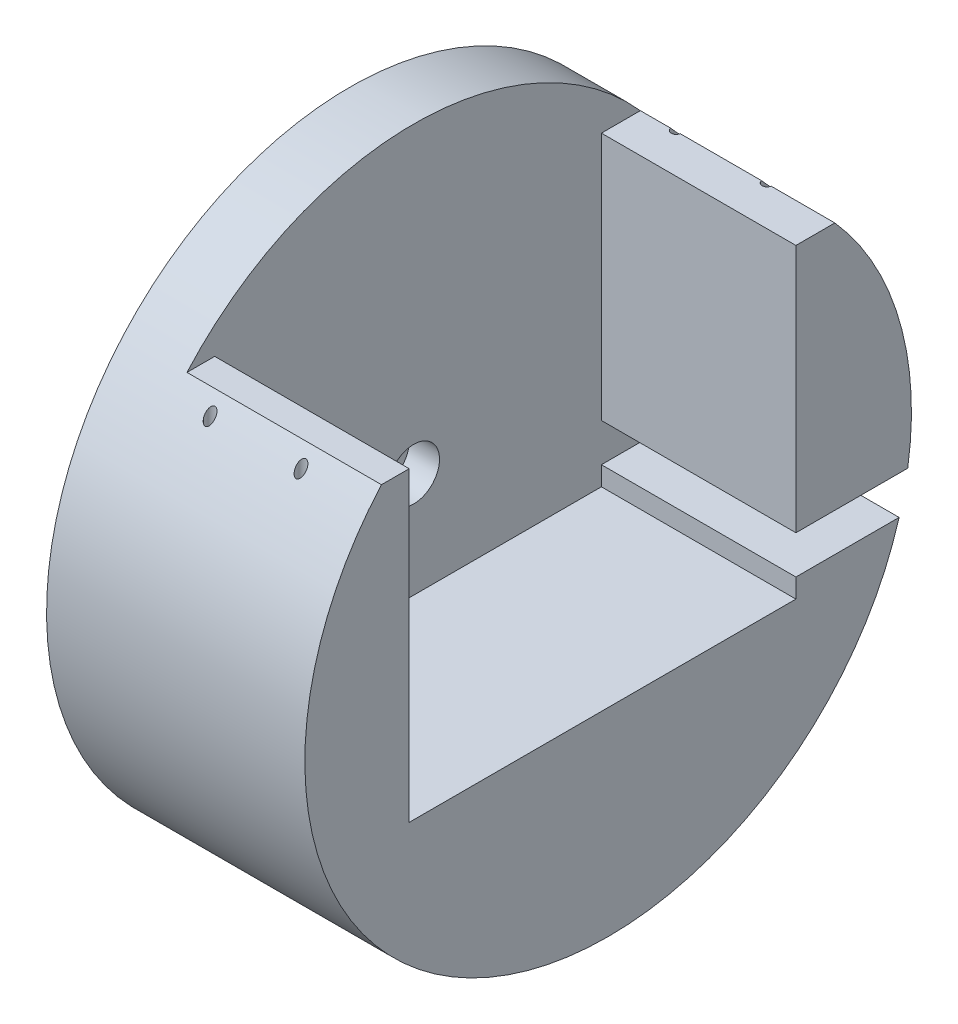
ISO-10303-21;
HEADER;
FILE_DESCRIPTION(('STEP AP214'),'2;1');
FILE_NAME('part.step','',(''),(''),'','','');
FILE_SCHEMA(('AUTOMOTIVE_DESIGN { 1 0 10303 214 1 1 1 1 }'));
ENDSEC;
DATA;
#1=APPLICATION_CONTEXT('core data for automotive mechanical design processes');
#2=APPLICATION_PROTOCOL_DEFINITION('international standard','automotive_design',2000,#1);
#3=PRODUCT_CONTEXT('',#1,'mechanical');
#4=PRODUCT('Part','Part','',(#3));
#5=PRODUCT_RELATED_PRODUCT_CATEGORY('part','',(#4));
#6=PRODUCT_DEFINITION_FORMATION('','',#4);
#7=PRODUCT_DEFINITION_CONTEXT('part definition',#1,'design');
#8=PRODUCT_DEFINITION('design','',#6,#7);
#9=PRODUCT_DEFINITION_SHAPE('','',#8);
#10=(LENGTH_UNIT() NAMED_UNIT(*) SI_UNIT(.MILLI.,.METRE.));
#11=(NAMED_UNIT(*) PLANE_ANGLE_UNIT() SI_UNIT($,.RADIAN.));
#12=(NAMED_UNIT(*) SI_UNIT($,.STERADIAN.) SOLID_ANGLE_UNIT());
#13=UNCERTAINTY_MEASURE_WITH_UNIT(LENGTH_MEASURE(1.E-05),#10,'distance_accuracy_value','');
#14=(GEOMETRIC_REPRESENTATION_CONTEXT(3) GLOBAL_UNCERTAINTY_ASSIGNED_CONTEXT((#13)) GLOBAL_UNIT_ASSIGNED_CONTEXT((#10,
#11,#12)) REPRESENTATION_CONTEXT('',''));
#15=CARTESIAN_POINT('',(0.,0.,0.));
#16=DIRECTION('',(0.,0.,1.));
#17=DIRECTION('',(1.,0.,0.));
#18=AXIS2_PLACEMENT_3D('',#15,#16,#17);
#19=CARTESIAN_POINT('',(26.9875,0.,0.));
#20=DIRECTION('',(-1.,0.,0.));
#21=DIRECTION('',(0.,0.,1.));
#22=AXIS2_PLACEMENT_3D('',#19,#20,#21);
#23=CYLINDRICAL_SURFACE('',#22,31.6865);
#24=CARTESIAN_POINT('',(19.83,18.8894553835808,25.4405730588309));
#25=CARTESIAN_POINT('',(19.8093102805262,18.8894585338143,25.4405707558764));
#26=CARTESIAN_POINT('',(19.7885869551605,18.8911804631478,25.4392924776839));
#27=CARTESIAN_POINT('',(19.7479522247744,18.8978685636467,25.4343244834897));
#28=CARTESIAN_POINT('',(19.728043167384,18.9028434970198,25.4306282545463));
#29=CARTESIAN_POINT('',(19.6898609663298,18.9154501320512,25.4212526941045));
#30=CARTESIAN_POINT('',(19.6715724136049,18.9230524148981,25.4155953197819));
#31=CARTESIAN_POINT('',(19.6366440755752,18.9403521521329,25.402705749786));
#32=CARTESIAN_POINT('',(19.6200046567926,18.9500500707623,25.395473205166));
#33=CARTESIAN_POINT('',(19.5794586252006,18.9769859469778,25.3753562089654));
#34=CARTESIAN_POINT('',(19.5567660540923,18.9953857498577,25.3615890520432));
#35=CARTESIAN_POINT('',(19.5151830959073,19.0347197921008,25.3320811791229));
#36=CARTESIAN_POINT('',(19.4963035165116,19.0556609735175,25.3163350529828));
#37=CARTESIAN_POINT('',(19.451608827369,19.1122661221448,25.2736513671141));
#38=CARTESIAN_POINT('',(19.428434513184,19.1492213165409,25.245670231765));
#39=CARTESIAN_POINT('',(19.3893587948955,19.2253341374507,25.1877574012077));
#40=CARTESIAN_POINT('',(19.3734728353713,19.2644962453365,25.1578217159959));
#41=CARTESIAN_POINT('',(19.3429622210163,19.3601699232598,25.0843189310782));
#42=CARTESIAN_POINT('',(19.3314915348214,19.4172462105906,25.040169571693));
#43=CARTESIAN_POINT('',(19.3203441281249,19.5318041383596,24.9509156928634));
#44=CARTESIAN_POINT('',(19.3206744114383,19.5892859992719,24.9058106220786));
#45=CARTESIAN_POINT('',(19.3323363849155,19.6927282303482,24.8240662792088));
#46=CARTESIAN_POINT('',(19.3416546660789,19.738881302879,24.7873804441949));
#47=CARTESIAN_POINT('',(19.3692745415467,19.8292974882041,24.7151079408116));
#48=CARTESIAN_POINT('',(19.387552595846,19.8735652248854,24.6795186505022));
#49=CARTESIAN_POINT('',(19.425229144856,19.9415281879422,24.6245980080875));
#50=CARTESIAN_POINT('',(19.4412899983247,19.9664024647391,24.6044307019793));
#51=CARTESIAN_POINT('',(19.4777091278029,20.0141475525432,24.5656084411354));
#52=CARTESIAN_POINT('',(19.4980626621403,20.0370205350492,24.5469518488848));
#53=CARTESIAN_POINT('',(19.5378520796895,20.0743457144022,24.5164303405439));
#54=CARTESIAN_POINT('',(19.5562415397588,20.08947232548,24.5040345691746));
#55=CARTESIAN_POINT('',(19.595846970969,20.1173183439096,24.4811786392303));
#56=CARTESIAN_POINT('',(19.6170583032384,20.130041620762,24.4707153698351));
#57=CARTESIAN_POINT('',(19.6569297836749,20.1496148129037,24.4545993142483));
#58=CARTESIAN_POINT('',(19.6750304534118,20.1571424682208,24.4483937480344));
#59=CARTESIAN_POINT('',(19.7125918472146,20.169810539115,24.4379437108478));
#60=CARTESIAN_POINT('',(19.7320514613193,20.1749528773337,24.4336976604571));
#61=CARTESIAN_POINT('',(19.7720128471884,20.182473129171,24.4274862705886));
#62=CARTESIAN_POINT('',(19.7925210386004,20.18483115138,24.4255373421368));
#63=CARTESIAN_POINT('',(19.8337436116043,20.1864868700268,24.4241690054825));
#64=CARTESIAN_POINT('',(19.8544579157808,20.1857856751987,24.4247486808528));
#65=CARTESIAN_POINT('',(19.8931152967752,20.181637456028,24.4281762989158));
#66=CARTESIAN_POINT('',(19.9111156312689,20.1784958779059,24.4307719143431));
#67=CARTESIAN_POINT('',(19.9462463295584,20.1700713165816,24.4377276979013));
#68=CARTESIAN_POINT('',(19.963376357077,20.1647875126219,24.4420885423488));
#69=CARTESIAN_POINT('',(20.0020642181604,20.1502940375625,24.4540394776417));
#70=CARTESIAN_POINT('',(20.0231670737147,20.1403613384091,24.462222637109));
#71=CARTESIAN_POINT('',(20.0630145030306,20.1179832025466,24.4806299955895));
#72=CARTESIAN_POINT('',(20.0817542909981,20.1055327954637,24.4908582314669));
#73=CARTESIAN_POINT('',(20.1246913349536,20.0727968581033,24.5177023593913));
#74=CARTESIAN_POINT('',(20.147596718316,20.0514929426562,24.5351330091002));
#75=CARTESIAN_POINT('',(20.1888600319656,20.0063614125871,24.5719482877168));
#76=CARTESIAN_POINT('',(20.2072089580634,19.9825289316782,24.5913366807586));
#77=CARTESIAN_POINT('',(20.2486977639578,19.9198589992352,24.6421564803748));
#78=CARTESIAN_POINT('',(20.2690647735638,19.8798751617284,24.6744318672842));
#79=CARTESIAN_POINT('',(20.3016595503464,19.7977945896491,24.7403397320299));
#80=CARTESIAN_POINT('',(20.3138700629336,19.7556935772132,24.7739749281669));
#81=CARTESIAN_POINT('',(20.333898712741,19.6561925923786,24.8530406797598));
#82=CARTESIAN_POINT('',(20.3388933383496,19.5983735712091,24.8986635184003));
#83=CARTESIAN_POINT('',(20.336848110102,19.4825427759184,24.9894022535868));
#84=CARTESIAN_POINT('',(20.3298052066105,19.4245309566692,25.0345180187539));
#85=CARTESIAN_POINT('',(20.3065600844824,19.3243578049371,25.1118783303518));
#86=CARTESIAN_POINT('',(20.2930895279043,19.2818613039588,25.1445196836792));
#87=CARTESIAN_POINT('',(20.2583736552766,19.1987727508709,25.2080168152442));
#88=CARTESIAN_POINT('',(20.2371492065189,19.158175914131,25.2388771308686));
#89=CARTESIAN_POINT('',(20.1961434186571,19.0966108676469,25.2854615574007));
#90=CARTESIAN_POINT('',(20.1793430746168,19.0744233938094,25.3022008077466));
#91=CARTESIAN_POINT('',(20.1421259212142,19.0320046390651,25.3341228304291));
#92=CARTESIAN_POINT('',(20.1217129063033,19.0117713397881,25.3493072097134));
#93=CARTESIAN_POINT('',(20.0825457335206,18.9790744173813,25.3737920734209));
#94=CARTESIAN_POINT('',(20.0646801689167,18.9659406546869,25.3836088998475));
#95=CARTESIAN_POINT('',(20.0266062216382,18.9420327907083,25.4014546352895));
#96=CARTESIAN_POINT('',(20.0064012725228,18.9312552965846,25.4094861153449));
#97=CARTESIAN_POINT('',(19.9688059164482,18.9150620530129,25.421541797503));
#98=CARTESIAN_POINT('',(19.9518634260407,18.9089817793049,25.4260639375508));
#99=CARTESIAN_POINT('',(19.9169786754766,18.8991315694367,25.4333864529377));
#100=CARTESIAN_POINT('',(19.899039005216,18.8953559278586,25.4361910802605));
#101=CARTESIAN_POINT('',(19.8724450516524,18.8917522345801,25.4388675352602));
#102=CARTESIAN_POINT('',(19.8639941493697,18.8908932911226,25.4395053713194));
#103=CARTESIAN_POINT('',(19.8470307415659,18.8897441351985,25.440358668028));
#104=CARTESIAN_POINT('',(19.8385182190049,18.8894540865899,25.4405740069863));
#105=CARTESIAN_POINT('',(19.83,18.8894553835808,25.4405730588309));
#106=B_SPLINE_CURVE_WITH_KNOTS('',3,(#24,#25,#26,#27,#28,#29,#30,#31,#32,#33,#34,#35,#36,#37,
#38,#39,#40,#41,#42,#43,#44,#45,#46,#47,#48,#49,#50,#51,#52,#53,#54,#55,#56,#57,#58,#59,#60,#61,
#62,#63,#64,#65,#66,#67,#68,#69,#70,#71,#72,#73,#74,#75,#76,#77,#78,#79,#80,#81,#82,#83,#84,#85,
#86,#87,#88,#89,#90,#91,#92,#93,#94,#95,#96,#97,#98,#99,#100,#101,#102,#103,#104,#105),
.UNSPECIFIED.,.T.,.F.,(4,2,2,2,2,2,2,2,2,2,2,2,2,2,2,2,2,2,2,2,2,2,2,2,2,2,2,2,2,2,2,2,2,2,2,2,
2,2,2,2,4),(0.,0.062024621698036,0.124217003375817,0.185734435437836,0.247265509313762,
0.343605802773783,0.440215448312786,0.594824454392598,0.749759592437186,0.967852867605808,
1.18607558216736,1.36457759018983,1.54261311347408,1.64983153617511,1.75693214051658,
1.83721437104919,1.91736621996479,1.9788168924133,2.04021794722316,2.10205505273545,
2.16386974884927,2.21899314211912,2.27413767497426,2.34787914456867,2.42176763878716,
2.52859897697739,2.6356397780366,2.80054979662039,2.96580757709227,3.18618638999723,
3.40662104282019,3.57191832056959,3.73677398802291,3.83398885916243,3.93110222332757,
4.00362723809671,4.07604712458024,4.1315188252873,4.18685263560642,4.21238160430581,
4.23791792498865),.UNSPECIFIED.);
#107=CARTESIAN_POINT('',(19.83,18.8894553835808,25.4405730588309));
#108=VERTEX_POINT('',#107);
#109=EDGE_CURVE('E194',#108,#108,#106,.T.);
#110=ORIENTED_EDGE('',*,*,#109,.T.);
#111=EDGE_LOOP('',(#110));
#112=FACE_BOUND('',#111,.T.);
#113=CARTESIAN_POINT('',(10.33,18.8894553835808,25.4405730588309));
#114=CARTESIAN_POINT('',(10.3093102805262,18.8894585338143,25.4405707558764));
#115=CARTESIAN_POINT('',(10.2885869551605,18.8911804631478,25.4392924776839));
#116=CARTESIAN_POINT('',(10.2479522247744,18.8978685636467,25.4343244834897));
#117=CARTESIAN_POINT('',(10.228043167384,18.9028434970198,25.4306282545463));
#118=CARTESIAN_POINT('',(10.1898609663298,18.9154501320512,25.4212526941045));
#119=CARTESIAN_POINT('',(10.1715724136049,18.9230524148981,25.4155953197819));
#120=CARTESIAN_POINT('',(10.1366440755752,18.9403521521329,25.402705749786));
#121=CARTESIAN_POINT('',(10.1200046567926,18.9500500707623,25.395473205166));
#122=CARTESIAN_POINT('',(10.0794586252006,18.9769859469778,25.3753562089654));
#123=CARTESIAN_POINT('',(10.0567660540923,18.9953857498577,25.3615890520432));
#124=CARTESIAN_POINT('',(10.0151830959073,19.0347197921008,25.3320811791229));
#125=CARTESIAN_POINT('',(9.99630351651162,19.0556609735175,25.3163350529828));
#126=CARTESIAN_POINT('',(9.95160882736904,19.1122661221448,25.2736513671141));
#127=CARTESIAN_POINT('',(9.92843451318396,19.1492213165409,25.245670231765));
#128=CARTESIAN_POINT('',(9.88935879489549,19.2253341374508,25.1877574012077));
#129=CARTESIAN_POINT('',(9.87347283537131,19.2644962453366,25.1578217159959));
#130=CARTESIAN_POINT('',(9.84296222101629,19.3601699232598,25.0843189310782));
#131=CARTESIAN_POINT('',(9.83149153482144,19.4172462105906,25.0401695716929));
#132=CARTESIAN_POINT('',(9.82034412812489,19.5318041383597,24.9509156928634));
#133=CARTESIAN_POINT('',(9.82067441143827,19.5892859992719,24.9058106220786));
#134=CARTESIAN_POINT('',(9.83233638491556,19.6927282303482,24.8240662792087));
#135=CARTESIAN_POINT('',(9.84165466607891,19.738881302879,24.7873804441949));
#136=CARTESIAN_POINT('',(9.86927454154673,19.8292974882041,24.7151079408116));
#137=CARTESIAN_POINT('',(9.88755259584599,19.8735652248854,24.6795186505022));
#138=CARTESIAN_POINT('',(9.92522914485605,19.9415281879422,24.6245980080875));
#139=CARTESIAN_POINT('',(9.9412899983247,19.9664024647391,24.6044307019793));
#140=CARTESIAN_POINT('',(9.97770912780293,20.0141475525432,24.5656084411354));
#141=CARTESIAN_POINT('',(9.99806266214034,20.0370205350492,24.5469518488848));
#142=CARTESIAN_POINT('',(10.0378520796896,20.0743457144022,24.5164303405438));
#143=CARTESIAN_POINT('',(10.0562415397588,20.08947232548,24.5040345691746));
#144=CARTESIAN_POINT('',(10.095846970969,20.1173183439096,24.4811786392303));
#145=CARTESIAN_POINT('',(10.1170583032384,20.130041620762,24.4707153698351));
#146=CARTESIAN_POINT('',(10.156929783675,20.1496148129037,24.4545993142483));
#147=CARTESIAN_POINT('',(10.1750304534119,20.1571424682208,24.4483937480344));
#148=CARTESIAN_POINT('',(10.2125918472146,20.169810539115,24.4379437108478));
#149=CARTESIAN_POINT('',(10.2320514613193,20.1749528773337,24.4336976604571));
#150=CARTESIAN_POINT('',(10.2720128471885,20.182473129171,24.4274862705886));
#151=CARTESIAN_POINT('',(10.2925210386004,20.18483115138,24.4255373421368));
#152=CARTESIAN_POINT('',(10.3337436116043,20.1864868700268,24.4241690054825));
#153=CARTESIAN_POINT('',(10.3544579157809,20.1857856751987,24.4247486808528));
#154=CARTESIAN_POINT('',(10.3931152967752,20.181637456028,24.4281762989158));
#155=CARTESIAN_POINT('',(10.4111156312689,20.1784958779059,24.4307719143431));
#156=CARTESIAN_POINT('',(10.4462463295584,20.1700713165816,24.4377276979013));
#157=CARTESIAN_POINT('',(10.463376357077,20.1647875126219,24.4420885423488));
#158=CARTESIAN_POINT('',(10.5020642181604,20.1502940375625,24.4540394776417));
#159=CARTESIAN_POINT('',(10.5231670737147,20.1403613384091,24.462222637109));
#160=CARTESIAN_POINT('',(10.5630145030306,20.1179832025466,24.4806299955895));
#161=CARTESIAN_POINT('',(10.5817542909981,20.1055327954637,24.4908582314669));
#162=CARTESIAN_POINT('',(10.6246913349536,20.0727968581033,24.5177023593913));
#163=CARTESIAN_POINT('',(10.647596718316,20.0514929426562,24.5351330091002));
#164=CARTESIAN_POINT('',(10.6888600319656,20.0063614125871,24.5719482877168));
#165=CARTESIAN_POINT('',(10.7072089580634,19.9825289316782,24.5913366807586));
#166=CARTESIAN_POINT('',(10.7486977639578,19.9198589992352,24.6421564803748));
#167=CARTESIAN_POINT('',(10.7690647735638,19.8798751617284,24.6744318672842));
#168=CARTESIAN_POINT('',(10.8016595503464,19.7977945896491,24.7403397320299));
#169=CARTESIAN_POINT('',(10.8138700629337,19.7556935772131,24.7739749281669));
#170=CARTESIAN_POINT('',(10.833898712741,19.6561925923786,24.8530406797598));
#171=CARTESIAN_POINT('',(10.8388933383496,19.5983735712091,24.8986635184003));
#172=CARTESIAN_POINT('',(10.836848110102,19.4825427759184,24.9894022535868));
#173=CARTESIAN_POINT('',(10.8298052066106,19.4245309566692,25.0345180187539));
#174=CARTESIAN_POINT('',(10.8065600844824,19.3243578049371,25.1118783303518));
#175=CARTESIAN_POINT('',(10.7930895279043,19.2818613039588,25.1445196836792));
#176=CARTESIAN_POINT('',(10.7583736552766,19.1987727508709,25.2080168152442));
#177=CARTESIAN_POINT('',(10.7371492065189,19.158175914131,25.2388771308686));
#178=CARTESIAN_POINT('',(10.6961434186572,19.0966108676469,25.2854615574007));
#179=CARTESIAN_POINT('',(10.6793430746168,19.0744233938094,25.3022008077466));
#180=CARTESIAN_POINT('',(10.6421259212142,19.0320046390651,25.3341228304291));
#181=CARTESIAN_POINT('',(10.6217129063033,19.0117713397881,25.3493072097134));
#182=CARTESIAN_POINT('',(10.5825457335206,18.9790744173813,25.3737920734209));
#183=CARTESIAN_POINT('',(10.5646801689167,18.9659406546869,25.3836088998475));
#184=CARTESIAN_POINT('',(10.5266062216382,18.9420327907083,25.4014546352895));
#185=CARTESIAN_POINT('',(10.5064012725228,18.9312552965847,25.4094861153449));
#186=CARTESIAN_POINT('',(10.4688059164482,18.9150620530129,25.421541797503));
#187=CARTESIAN_POINT('',(10.4518634260407,18.9089817793049,25.4260639375508));
#188=CARTESIAN_POINT('',(10.4169786754766,18.8991315694367,25.4333864529377));
#189=CARTESIAN_POINT('',(10.399039005216,18.8953559278586,25.4361910802605));
#190=CARTESIAN_POINT('',(10.3724450516524,18.8917522345801,25.4388675352602));
#191=CARTESIAN_POINT('',(10.3639941493697,18.8908932911225,25.4395053713194));
#192=CARTESIAN_POINT('',(10.3470307415659,18.8897441351985,25.440358668028));
#193=CARTESIAN_POINT('',(10.3385182190049,18.8894540865899,25.4405740069863));
#194=CARTESIAN_POINT('',(10.33,18.8894553835808,25.4405730588309));
#195=B_SPLINE_CURVE_WITH_KNOTS('',3,(#113,#114,#115,#116,#117,#118,#119,#120,#121,#122,#123,
#124,#125,#126,#127,#128,#129,#130,#131,#132,#133,#134,#135,#136,#137,#138,#139,#140,#141,#142,
#143,#144,#145,#146,#147,#148,#149,#150,#151,#152,#153,#154,#155,#156,#157,#158,#159,#160,#161,
#162,#163,#164,#165,#166,#167,#168,#169,#170,#171,#172,#173,#174,#175,#176,#177,#178,#179,#180,
#181,#182,#183,#184,#185,#186,#187,#188,#189,#190,#191,#192,#193,#194),.UNSPECIFIED.,.T.,.F.,(4,
2,2,2,2,2,2,2,2,2,2,2,2,2,2,2,2,2,2,2,2,2,2,2,2,2,2,2,2,2,2,2,2,2,2,2,2,2,2,2,4),(0.,
0.0620246216980382,0.124217003375818,0.185734435437839,0.247265509313766,0.34360580277379,
0.440215448312797,0.594824454392611,0.749759592437202,0.967852867605828,1.18607558216738,
1.36457759018985,1.54261311347409,1.64983153617511,1.75693214051658,1.8372143710492,
1.91736621996479,1.9788168924133,2.04021794722316,2.10205505273545,2.16386974884926,
2.21899314211911,2.27413767497425,2.34787914456866,2.42176763878714,2.52859897697739,
2.6356397780366,2.80054979662039,2.96580757709227,3.18618638999723,3.40662104282019,
3.57191832056959,3.7367739880229,3.83398885916242,3.93110222332755,4.0036272380967,
4.07604712458023,4.1315188252873,4.18685263560641,4.2123816043058,4.23791792498864),.UNSPECIFIED.);
#196=CARTESIAN_POINT('',(10.33,18.8894553835808,25.4405730588309));
#197=VERTEX_POINT('',#196);
#198=EDGE_CURVE('E225',#197,#197,#195,.T.);
#199=ORIENTED_EDGE('',*,*,#198,.T.);
#200=EDGE_LOOP('',(#199));
#201=FACE_BOUND('',#200,.T.);
#202=DIRECTION('',(1.,0.,0.));
#203=VECTOR('',#202,1.);
#204=CARTESIAN_POINT('',(6.6675,21.0499999999999,-23.6839984430418));
#205=LINE('',#204,#203);
#206=CARTESIAN_POINT('',(6.6675,21.0499999999999,-23.6839984430418));
#207=VERTEX_POINT('',#206);
#208=CARTESIAN_POINT('',(9.82807118352961,21.0499999999999,-23.6839984430418));
#209=VERTEX_POINT('',#208);
#210=EDGE_CURVE('E145',#207,#209,#205,.T.);
#211=ORIENTED_EDGE('',*,*,#210,.T.);
#212=CARTESIAN_POINT('',(9.82807118352961,21.0499999999998,-23.6839984430418));
#213=CARTESIAN_POINT('',(9.82475945644483,21.0260446132725,-23.7052902899031));
#214=CARTESIAN_POINT('',(9.82280729321748,21.0019543095868,-23.7266357303858));
#215=CARTESIAN_POINT('',(9.82159715594524,20.9536518311515,-23.7693034892083));
#216=CARTESIAN_POINT('',(9.82234127576032,20.9294395762741,-23.7906257767099));
#217=CARTESIAN_POINT('',(9.82652429591241,20.8808411905774,-23.8332920727493));
#218=CARTESIAN_POINT('',(9.82998961485304,20.856455690253,-23.8546342343349));
#219=CARTESIAN_POINT('',(9.83969136879888,20.8079466788321,-23.8969595006064));
#220=CARTESIAN_POINT('',(9.84592660580344,20.7838230590871,-23.9179427564503));
#221=CARTESIAN_POINT('',(9.86478922406582,20.7250585211927,-23.9689039373375));
#222=CARTESIAN_POINT('',(9.87903673498725,20.6906687616886,-23.9985929886631));
#223=CARTESIAN_POINT('',(9.91417655518537,20.6238420826478,-24.0560459422104));
#224=CARTESIAN_POINT('',(9.93504546025926,20.5913987563317,-24.0838162118562));
#225=CARTESIAN_POINT('',(9.97585958760968,20.540436437058,-24.1272763703729));
#226=CARTESIAN_POINT('',(9.99366762837965,20.5209575755696,-24.1438433103722));
#227=CARTESIAN_POINT('',(10.0328450851211,20.4841439608275,-24.17508441987));
#228=CARTESIAN_POINT('',(10.0542099567003,20.4668065202002,-24.1897609627321));
#229=CARTESIAN_POINT('',(10.0949019013652,20.4392135256079,-24.2130765342079));
#230=CARTESIAN_POINT('',(10.1134163866248,20.4282686865251,-24.2223096265388));
#231=CARTESIAN_POINT('',(10.1524957752725,20.4087576987429,-24.2387510821282));
#232=CARTESIAN_POINT('',(10.1730577787487,20.4001882491052,-24.2459622552906));
#233=CARTESIAN_POINT('',(10.2122070594111,20.387300998601,-24.2567990279444));
#234=CARTESIAN_POINT('',(10.230523270198,20.382504818801,-24.2608285310861));
#235=CARTESIAN_POINT('',(10.267949380801,20.3753314293992,-24.2668533975649));
#236=CARTESIAN_POINT('',(10.2870587025288,20.3729524890464,-24.2688502163122));
#237=CARTESIAN_POINT('',(10.3255849022087,20.370808670469,-24.2706497355606));
#238=CARTESIAN_POINT('',(10.3450025026493,20.3710512771126,-24.2704461536222));
#239=CARTESIAN_POINT('',(10.3834788364263,20.3741469390982,-24.2678475054635));
#240=CARTESIAN_POINT('',(10.4025374630704,20.377000758416,-24.2654517978818));
#241=CARTESIAN_POINT('',(10.439065266468,20.384930132183,-24.258790794522));
#242=CARTESIAN_POINT('',(10.4565672071625,20.3899189388563,-24.2545984888989));
#243=CARTESIAN_POINT('',(10.4904353468678,20.4017752059312,-24.2446264306619));
#244=CARTESIAN_POINT('',(10.5068010624814,20.4086434598612,-24.238846007519));
#245=CARTESIAN_POINT('',(10.5462237130199,20.4278061400287,-24.2227009883475));
#246=CARTESIAN_POINT('',(10.5684596627093,20.4410851241473,-24.2114989269343));
#247=CARTESIAN_POINT('',(10.6098889143843,20.4701498148327,-24.1869306424262));
#248=CARTESIAN_POINT('',(10.6290745910548,20.4859416121,-24.1735591593773));
#249=CARTESIAN_POINT('',(10.6730932794881,20.5273197821651,-24.1384437412612));
#250=CARTESIAN_POINT('',(10.6961904151201,20.5539580739508,-24.1157710112151));
#251=CARTESIAN_POINT('',(10.7367050447311,20.6095330761705,-24.0682940454951));
#252=CARTESIAN_POINT('',(10.7541097948449,20.6384747658135,-24.0434851821634));
#253=CARTESIAN_POINT('',(10.7901970832932,20.7104613830887,-23.9815383120973));
#254=CARTESIAN_POINT('',(10.8062157173099,20.7542231529256,-23.9436827862117));
#255=CARTESIAN_POINT('',(10.828800187254,20.8428445491794,-23.8665785347857));
#256=CARTESIAN_POINT('',(10.8353685276441,20.8877038815205,-23.8273301811908));
#257=CARTESIAN_POINT('',(10.8382273212539,20.9522010214597,-23.7705752099854));
#258=CARTESIAN_POINT('',(10.8382167755011,20.9718673306277,-23.7532260679187));
#259=CARTESIAN_POINT('',(10.8364101242926,21.0110495935055,-23.7185741459495));
#260=CARTESIAN_POINT('',(10.8346195581734,21.0305658243877,-23.7012713891869));
#261=CARTESIAN_POINT('',(10.831928816471,21.0499999999998,-23.6839984430419));
#262=B_SPLINE_CURVE_WITH_KNOTS('',3,(#212,#213,#214,#215,#216,#217,#218,#219,#220,#221,#222,
#223,#224,#225,#226,#227,#228,#229,#230,#231,#232,#233,#234,#235,#236,#237,#238,#239,#240,#241,
#242,#243,#244,#245,#246,#247,#248,#249,#250,#251,#252,#253,#254,#255,#256,#257,#258,#259,#260,
#261),.UNSPECIFIED.,.F.,.F.,(4,2,2,2,2,2,2,2,2,2,2,2,2,2,2,2,2,2,2,2,2,2,2,2,4),(0.,
0.0966267842017628,0.193328622208077,0.290981068671956,0.38859132111891,0.53097284593616,
0.672856608015563,0.766086966440662,0.85919911041858,0.929176664849575,0.999056482453045,
1.05688396236312,1.11467000838046,1.17262108480146,1.23058912168644,1.28639717555777,
1.3422288288032,1.42640453646034,1.51078747228152,1.63584691381268,1.76118444644079,
1.94037329054293,2.11951463829362,2.19813914565482,2.2765197409113),.UNSPECIFIED.);
#263=CARTESIAN_POINT('',(10.8319288164704,21.0499999999998,-23.6839984430418));
#264=VERTEX_POINT('',#263);
#265=EDGE_CURVE('E58',#209,#264,#262,.T.);
#266=ORIENTED_EDGE('',*,*,#265,.T.);
#267=CARTESIAN_POINT('',(19.3280711835296,21.0499999999999,-23.6839984430418));
#268=VERTEX_POINT('',#267);
#269=EDGE_CURVE('E135',#264,#268,#205,.T.);
#270=ORIENTED_EDGE('',*,*,#269,.T.);
#271=CARTESIAN_POINT('',(19.3280711835296,21.0499999999998,-23.6839984430418));
#272=CARTESIAN_POINT('',(19.3247594564448,21.0260446132725,-23.7052902899031));
#273=CARTESIAN_POINT('',(19.3228072932175,21.0019543095868,-23.7266357303858));
#274=CARTESIAN_POINT('',(19.3215971559452,20.9536518311515,-23.7693034892083));
#275=CARTESIAN_POINT('',(19.3223412757603,20.9294395762741,-23.7906257767099));
#276=CARTESIAN_POINT('',(19.3265242959124,20.8808411905774,-23.8332920727493));
#277=CARTESIAN_POINT('',(19.329989614853,20.856455690253,-23.8546342343349));
#278=CARTESIAN_POINT('',(19.3396913687989,20.8079466788321,-23.8969595006063));
#279=CARTESIAN_POINT('',(19.3459266058034,20.7838230590871,-23.9179427564503));
#280=CARTESIAN_POINT('',(19.3647892240658,20.7250585211927,-23.9689039373375));
#281=CARTESIAN_POINT('',(19.3790367349872,20.6906687616886,-23.9985929886631));
#282=CARTESIAN_POINT('',(19.4141765551854,20.6238420826478,-24.0560459422103));
#283=CARTESIAN_POINT('',(19.4350454602592,20.5913987563317,-24.0838162118562));
#284=CARTESIAN_POINT('',(19.4758595876097,20.540436437058,-24.1272763703729));
#285=CARTESIAN_POINT('',(19.4936676283796,20.5209575755696,-24.1438433103722));
#286=CARTESIAN_POINT('',(19.5328450851211,20.4841439608275,-24.17508441987));
#287=CARTESIAN_POINT('',(19.5542099567003,20.4668065202002,-24.1897609627321));
#288=CARTESIAN_POINT('',(19.5949019013651,20.4392135256079,-24.2130765342079));
#289=CARTESIAN_POINT('',(19.6134163866248,20.4282686865251,-24.2223096265388));
#290=CARTESIAN_POINT('',(19.6524957752725,20.4087576987429,-24.2387510821282));
#291=CARTESIAN_POINT('',(19.6730577787486,20.4001882491052,-24.2459622552906));
#292=CARTESIAN_POINT('',(19.7122070594111,20.387300998601,-24.2567990279444));
#293=CARTESIAN_POINT('',(19.730523270198,20.382504818801,-24.2608285310861));
#294=CARTESIAN_POINT('',(19.767949380801,20.3753314293992,-24.2668533975649));
#295=CARTESIAN_POINT('',(19.7870587025287,20.3729524890464,-24.2688502163122));
#296=CARTESIAN_POINT('',(19.8255849022087,20.370808670469,-24.2706497355606));
#297=CARTESIAN_POINT('',(19.8450025026493,20.3710512771126,-24.2704461536222));
#298=CARTESIAN_POINT('',(19.8834788364263,20.3741469390982,-24.2678475054635));
#299=CARTESIAN_POINT('',(19.9025374630704,20.377000758416,-24.2654517978818));
#300=CARTESIAN_POINT('',(19.939065266468,20.384930132183,-24.258790794522));
#301=CARTESIAN_POINT('',(19.9565672071625,20.3899189388563,-24.2545984888989));
#302=CARTESIAN_POINT('',(19.9904353468678,20.4017752059312,-24.2446264306619));
#303=CARTESIAN_POINT('',(20.0068010624814,20.4086434598611,-24.238846007519));
#304=CARTESIAN_POINT('',(20.0462237130198,20.4278061400286,-24.2227009883475));
#305=CARTESIAN_POINT('',(20.0684596627093,20.4410851241472,-24.2114989269343));
#306=CARTESIAN_POINT('',(20.1098889143843,20.4701498148327,-24.1869306424262));
#307=CARTESIAN_POINT('',(20.1290745910547,20.4859416121,-24.1735591593773));
#308=CARTESIAN_POINT('',(20.1730932794881,20.5273197821651,-24.1384437412612));
#309=CARTESIAN_POINT('',(20.1961904151201,20.5539580739508,-24.1157710112151));
#310=CARTESIAN_POINT('',(20.236705044731,20.6095330761705,-24.0682940454951));
#311=CARTESIAN_POINT('',(20.2541097948449,20.6384747658135,-24.0434851821634));
#312=CARTESIAN_POINT('',(20.2901970832932,20.7104613830887,-23.9815383120973));
#313=CARTESIAN_POINT('',(20.3062157173099,20.7542231529256,-23.9436827862117));
#314=CARTESIAN_POINT('',(20.328800187254,20.8428445491794,-23.8665785347857));
#315=CARTESIAN_POINT('',(20.3353685276441,20.8877038815205,-23.8273301811908));
#316=CARTESIAN_POINT('',(20.3382273212539,20.9522010214596,-23.7705752099855));
#317=CARTESIAN_POINT('',(20.3382167755011,20.9718673306277,-23.7532260679187));
#318=CARTESIAN_POINT('',(20.3364101242925,21.0110495935055,-23.7185741459495));
#319=CARTESIAN_POINT('',(20.3346195581734,21.0305658243877,-23.7012713891869));
#320=CARTESIAN_POINT('',(20.331928816471,21.0499999999998,-23.6839984430419));
#321=B_SPLINE_CURVE_WITH_KNOTS('',3,(#271,#272,#273,#274,#275,#276,#277,#278,#279,#280,#281,
#282,#283,#284,#285,#286,#287,#288,#289,#290,#291,#292,#293,#294,#295,#296,#297,#298,#299,#300,
#301,#302,#303,#304,#305,#306,#307,#308,#309,#310,#311,#312,#313,#314,#315,#316,#317,#318,#319,
#320),.UNSPECIFIED.,.F.,.F.,(4,2,2,2,2,2,2,2,2,2,2,2,2,2,2,2,2,2,2,2,2,2,2,2,4),(0.,
0.0966267842017626,0.193328622208077,0.290981068671951,0.388591321118906,0.530972845936154,
0.672856608015551,0.766086966440652,0.859199110418577,0.92917666484957,0.999056482453038,
1.0568839623631,1.11467000838045,1.17262108480144,1.23058912168643,1.28639717555776,
1.34222882880319,1.42640453646032,1.5107874722815,1.63584691381267,1.76118444644076,
1.9403732905429,2.11951463829359,2.19813914565481,2.27651974091131),.UNSPECIFIED.);
#322=CARTESIAN_POINT('',(20.3319288164704,21.0499999999998,-23.6839984430418));
#323=VERTEX_POINT('',#322);
#324=EDGE_CURVE('E51',#268,#323,#321,.T.);
#325=ORIENTED_EDGE('',*,*,#324,.T.);
#326=CARTESIAN_POINT('',(26.9875,21.0499999999999,-23.6839984430418));
#327=VERTEX_POINT('',#326);
#328=EDGE_CURVE('E133',#323,#327,#205,.T.);
#329=ORIENTED_EDGE('',*,*,#328,.T.);
#330=CARTESIAN_POINT('',(26.9875,0.,0.));
#331=DIRECTION('',(1.,0.,0.));
#332=DIRECTION('',(0.,0.,-1.));
#333=AXIS2_PLACEMENT_3D('',#330,#331,#332);
#334=CIRCLE('',#333,31.6865);
#335=CARTESIAN_POINT('',(26.9875,-4.9499999999997,-31.297472457852));
#336=VERTEX_POINT('',#335);
#337=EDGE_CURVE('E338',#336,#327,#334,.T.);
#338=ORIENTED_EDGE('',*,*,#337,.F.);
#339=DIRECTION('',(1.,0.,0.));
#340=VECTOR('',#339,1.);
#341=CARTESIAN_POINT('',(6.6675,-4.9499999999997,-31.297472457852));
#342=LINE('',#341,#340);
#343=CARTESIAN_POINT('',(6.6675,-4.9499999999997,-31.297472457852));
#344=VERTEX_POINT('',#343);
#345=EDGE_CURVE('E167',#344,#336,#342,.T.);
#346=ORIENTED_EDGE('',*,*,#345,.F.);
#347=CARTESIAN_POINT('',(6.6675,0.,0.));
#348=DIRECTION('',(1.,0.,0.));
#349=DIRECTION('',(0.,0.,-1.));
#350=AXIS2_PLACEMENT_3D('',#347,#348,#349);
#351=CIRCLE('',#350,31.6865);
#352=CARTESIAN_POINT('',(6.6675,-8.94999999999969,-30.3962461868239));
#353=VERTEX_POINT('',#352);
#354=EDGE_CURVE('E196',#353,#344,#351,.T.);
#355=ORIENTED_EDGE('',*,*,#354,.F.);
#356=DIRECTION('',(1.,0.,0.));
#357=VECTOR('',#356,1.);
#358=CARTESIAN_POINT('',(6.6675,-8.94999999999969,-30.3962461868239));
#359=LINE('',#358,#357);
#360=CARTESIAN_POINT('',(26.9875,-8.94999999999969,-30.3962461868239));
#361=VERTEX_POINT('',#360);
#362=EDGE_CURVE('E164',#353,#361,#359,.T.);
#363=ORIENTED_EDGE('',*,*,#362,.T.);
#364=CARTESIAN_POINT('',(26.9875,21.0499999999998,23.6839984430418));
#365=VERTEX_POINT('',#364);
#366=EDGE_CURVE('E127',#365,#361,#334,.T.);
#367=ORIENTED_EDGE('',*,*,#366,.F.);
#368=DIRECTION('',(1.,0.,0.));
#369=VECTOR('',#368,1.);
#370=CARTESIAN_POINT('',(6.6675,21.0499999999998,23.6839984430418));
#371=LINE('',#370,#369);
#372=CARTESIAN_POINT('',(6.6675,21.0499999999998,23.6839984430418));
#373=VERTEX_POINT('',#372);
#374=EDGE_CURVE('E149',#373,#365,#371,.T.);
#375=ORIENTED_EDGE('',*,*,#374,.F.);
#376=EDGE_CURVE('E212',#207,#373,#351,.T.);
#377=ORIENTED_EDGE('',*,*,#376,.F.);
#378=EDGE_LOOP('',(#211,#266,#270,#325,#329,#338,#346,#355,#363,#367,#375,#377));
#379=FACE_BOUND('',#378,.T.);
#380=CARTESIAN_POINT('',(0.,0.,0.));
#381=DIRECTION('',(1.,0.,0.));
#382=DIRECTION('',(0.,0.,-1.));
#383=AXIS2_PLACEMENT_3D('',#380,#381,#382);
#384=CIRCLE('',#383,31.6865);
#385=CARTESIAN_POINT('',(0.,0.,-31.6865));
#386=VERTEX_POINT('',#385);
#387=EDGE_CURVE('E172',#386,#386,#384,.T.);
#388=ORIENTED_EDGE('',*,*,#387,.T.);
#389=EDGE_LOOP('',(#388));
#390=FACE_BOUND('',#389,.T.);
#391=ADVANCED_FACE('F35',(#112,#201,#379,#390),#23,.T.);
#392=CARTESIAN_POINT('',(26.9875,0.,0.));
#393=DIRECTION('',(1.,0.,0.));
#394=DIRECTION('',(0.,0.,-1.));
#395=AXIS2_PLACEMENT_3D('',#392,#393,#394);
#396=PLANE('',#395);
#397=DIRECTION('',(0.,-1.,0.));
#398=VECTOR('',#397,1.);
#399=CARTESIAN_POINT('',(26.9875,0.,-19.6148645221938));
#400=LINE('',#399,#398);
#401=CARTESIAN_POINT('',(26.9875,21.0499999999998,-19.6148645221937));
#402=VERTEX_POINT('',#401);
#403=CARTESIAN_POINT('',(26.9875,-4.9499999999997,-19.6148645221939));
#404=VERTEX_POINT('',#403);
#405=EDGE_CURVE('E191',#402,#404,#400,.T.);
#406=ORIENTED_EDGE('',*,*,#405,.T.);
#407=DIRECTION('',(0.,0.,-1.));
#408=VECTOR('',#407,1.);
#409=CARTESIAN_POINT('',(26.9875,-4.9499999999997,0.));
#410=LINE('',#409,#408);
#411=EDGE_CURVE('E173',#404,#336,#410,.T.);
#412=ORIENTED_EDGE('',*,*,#411,.T.);
#413=ORIENTED_EDGE('',*,*,#337,.T.);
#414=DIRECTION('',(0.,0.,-1.));
#415=VECTOR('',#414,1.);
#416=CARTESIAN_POINT('',(26.9875,21.0499999999995,2.87164235964596E-13));
#417=LINE('',#416,#415);
#418=EDGE_CURVE('E141',#402,#327,#417,.T.);
#419=ORIENTED_EDGE('',*,*,#418,.F.);
#420=EDGE_LOOP('',(#406,#412,#413,#419));
#421=FACE_BOUND('',#420,.T.);
#422=ADVANCED_FACE('F300',(#421),#396,.T.);
#423=DIRECTION('',(0.,0.,-1.));
#424=VECTOR('',#423,1.);
#425=CARTESIAN_POINT('',(26.9875,-8.9499999999997,0.));
#426=LINE('',#425,#424);
#427=CARTESIAN_POINT('',(26.9875,-8.9499999999997,-19.614864522198));
#428=VERTEX_POINT('',#427);
#429=EDGE_CURVE('E177',#428,#361,#426,.T.);
#430=ORIENTED_EDGE('',*,*,#429,.F.);
#431=DIRECTION('',(0.,1.,0.));
#432=VECTOR('',#431,1.);
#433=CARTESIAN_POINT('',(26.9875,0.,-19.614864522198));
#434=LINE('',#433,#432);
#435=CARTESIAN_POINT('',(26.9875,-10.9499999999997,-19.614864522198));
#436=VERTEX_POINT('',#435);
#437=EDGE_CURVE('E179',#436,#428,#434,.T.);
#438=ORIENTED_EDGE('',*,*,#437,.F.);
#439=DIRECTION('',(0.,0.,-1.));
#440=VECTOR('',#439,1.);
#441=CARTESIAN_POINT('',(26.9875,-10.9499999999997,0.));
#442=LINE('',#441,#440);
#443=CARTESIAN_POINT('',(26.9875,-10.9499999999997,20.7851354778061));
#444=VERTEX_POINT('',#443);
#445=EDGE_CURVE('E182',#444,#436,#442,.T.);
#446=ORIENTED_EDGE('',*,*,#445,.F.);
#447=DIRECTION('',(0.,-1.,0.));
#448=VECTOR('',#447,1.);
#449=CARTESIAN_POINT('',(26.9875,0.,20.7851354778062));
#450=LINE('',#449,#448);
#451=CARTESIAN_POINT('',(26.9875,21.0499999999998,20.7851354778063));
#452=VERTEX_POINT('',#451);
#453=EDGE_CURVE('E185',#452,#444,#450,.T.);
#454=ORIENTED_EDGE('',*,*,#453,.F.);
#455=DIRECTION('',(0.,0.,-1.));
#456=VECTOR('',#455,1.);
#457=CARTESIAN_POINT('',(26.9875,21.0499999999998,0.));
#458=LINE('',#457,#456);
#459=EDGE_CURVE('E188',#365,#452,#458,.T.);
#460=ORIENTED_EDGE('',*,*,#459,.F.);
#461=ORIENTED_EDGE('',*,*,#366,.T.);
#462=EDGE_LOOP('',(#430,#438,#446,#454,#460,#461));
#463=FACE_BOUND('',#462,.T.);
#464=ADVANCED_FACE('F305',(#463),#396,.T.);
#465=CARTESIAN_POINT('',(0.,0.,0.));
#466=DIRECTION('',(1.,0.,0.));
#467=DIRECTION('',(0.,0.,-1.));
#468=AXIS2_PLACEMENT_3D('',#465,#466,#467);
#469=PLANE('',#468);
#470=CARTESIAN_POINT('',(0.,0.,0.));
#471=DIRECTION('',(-1.,0.,0.));
#472=DIRECTION('',(0.,0.,1.));
#473=AXIS2_PLACEMENT_3D('',#470,#471,#472);
#474=CIRCLE('',#473,1.651);
#475=CARTESIAN_POINT('',(0.,0.,1.651));
#476=VERTEX_POINT('',#475);
#477=EDGE_CURVE('E331',#476,#476,#474,.T.);
#478=ORIENTED_EDGE('',*,*,#477,.F.);
#479=EDGE_LOOP('',(#478));
#480=FACE_BOUND('',#479,.T.);
#481=CARTESIAN_POINT('',(0.,19.9406274518954,-1.53992753876298));
#482=DIRECTION('',(-1.,0.,0.));
#483=DIRECTION('',(0.,0.,1.));
#484=AXIS2_PLACEMENT_3D('',#481,#482,#483);
#485=CIRCLE('',#484,0.508);
#486=CARTESIAN_POINT('',(0.,19.9406274518954,-1.03192753876298));
#487=VERTEX_POINT('',#486);
#488=EDGE_CURVE('E335',#487,#487,#485,.T.);
#489=ORIENTED_EDGE('',*,*,#488,.F.);
#490=EDGE_LOOP('',(#489));
#491=FACE_BOUND('',#490,.T.);
#492=ORIENTED_EDGE('',*,*,#387,.F.);
#493=EDGE_LOOP('',(#492));
#494=FACE_BOUND('',#493,.T.);
#495=ADVANCED_FACE('F316',(#480,#491,#494),#469,.F.);
#496=CARTESIAN_POINT('',(6.6675,0.,-19.6148645221938));
#497=DIRECTION('',(0.,0.,1.));
#498=DIRECTION('',(0.,-1.,0.));
#499=AXIS2_PLACEMENT_3D('',#496,#497,#498);
#500=PLANE('',#499);
#501=ORIENTED_EDGE('',*,*,#405,.F.);
#502=DIRECTION('',(1.,0.,0.));
#503=VECTOR('',#502,1.);
#504=CARTESIAN_POINT('',(6.6675,21.0499999999998,-19.6148645221937));
#505=LINE('',#504,#503);
#506=CARTESIAN_POINT('',(6.6675,21.0499999999998,-19.6148645221937));
#507=VERTEX_POINT('',#506);
#508=EDGE_CURVE('E143',#507,#402,#505,.T.);
#509=ORIENTED_EDGE('',*,*,#508,.F.);
#510=DIRECTION('',(0.,-1.,0.));
#511=VECTOR('',#510,1.);
#512=CARTESIAN_POINT('',(6.6675,0.,-19.6148645221938));
#513=LINE('',#512,#511);
#514=CARTESIAN_POINT('',(6.6675,-4.9499999999997,-19.6148645221939));
#515=VERTEX_POINT('',#514);
#516=EDGE_CURVE('E176',#507,#515,#513,.T.);
#517=ORIENTED_EDGE('',*,*,#516,.T.);
#518=DIRECTION('',(1.,0.,0.));
#519=VECTOR('',#518,1.);
#520=CARTESIAN_POINT('',(6.6675,-4.9499999999997,-19.6148645221939));
#521=LINE('',#520,#519);
#522=EDGE_CURVE('E169',#515,#404,#521,.T.);
#523=ORIENTED_EDGE('',*,*,#522,.T.);
#524=EDGE_LOOP('',(#501,#509,#517,#523));
#525=FACE_BOUND('',#524,.T.);
#526=ADVANCED_FACE('F319',(#525),#500,.T.);
#527=CARTESIAN_POINT('',(6.6675,-4.9499999999997,0.));
#528=DIRECTION('',(0.,-1.,0.));
#529=DIRECTION('',(0.,0.,-1.));
#530=AXIS2_PLACEMENT_3D('',#527,#528,#529);
#531=PLANE('',#530);
#532=ORIENTED_EDGE('',*,*,#411,.F.);
#533=ORIENTED_EDGE('',*,*,#522,.F.);
#534=DIRECTION('',(0.,0.,-1.));
#535=VECTOR('',#534,1.);
#536=CARTESIAN_POINT('',(6.6675,-4.9499999999997,0.));
#537=LINE('',#536,#535);
#538=EDGE_CURVE('E146',#515,#344,#537,.T.);
#539=ORIENTED_EDGE('',*,*,#538,.T.);
#540=ORIENTED_EDGE('',*,*,#345,.T.);
#541=EDGE_LOOP('',(#532,#533,#539,#540));
#542=FACE_BOUND('',#541,.T.);
#543=ADVANCED_FACE('F326',(#542),#531,.T.);
#544=CARTESIAN_POINT('',(6.6675,-8.9499999999997,0.));
#545=DIRECTION('',(0.,-1.,0.));
#546=DIRECTION('',(0.,0.,-1.));
#547=AXIS2_PLACEMENT_3D('',#544,#545,#546);
#548=PLANE('',#547);
#549=ORIENTED_EDGE('',*,*,#429,.T.);
#550=ORIENTED_EDGE('',*,*,#362,.F.);
#551=DIRECTION('',(0.,0.,-1.));
#552=VECTOR('',#551,1.);
#553=CARTESIAN_POINT('',(6.6675,-8.9499999999997,0.));
#554=LINE('',#553,#552);
#555=CARTESIAN_POINT('',(6.6675,-8.9499999999997,-19.614864522198));
#556=VERTEX_POINT('',#555);
#557=EDGE_CURVE('E197',#556,#353,#554,.T.);
#558=ORIENTED_EDGE('',*,*,#557,.F.);
#559=DIRECTION('',(1.,0.,0.));
#560=VECTOR('',#559,1.);
#561=CARTESIAN_POINT('',(6.6675,-8.9499999999997,-19.614864522198));
#562=LINE('',#561,#560);
#563=EDGE_CURVE('E162',#556,#428,#562,.T.);
#564=ORIENTED_EDGE('',*,*,#563,.T.);
#565=EDGE_LOOP('',(#549,#550,#558,#564));
#566=FACE_BOUND('',#565,.T.);
#567=ADVANCED_FACE('F351',(#566),#548,.F.);
#568=CARTESIAN_POINT('',(6.6675,0.,-19.614864522198));
#569=DIRECTION('',(0.,0.,-1.));
#570=DIRECTION('',(-1.,0.,0.));
#571=AXIS2_PLACEMENT_3D('',#568,#569,#570);
#572=PLANE('',#571);
#573=ORIENTED_EDGE('',*,*,#437,.T.);
#574=ORIENTED_EDGE('',*,*,#563,.F.);
#575=DIRECTION('',(0.,1.,0.));
#576=VECTOR('',#575,1.);
#577=CARTESIAN_POINT('',(6.6675,0.,-19.614864522198));
#578=LINE('',#577,#576);
#579=CARTESIAN_POINT('',(6.6675,-10.9499999999997,-19.614864522198));
#580=VERTEX_POINT('',#579);
#581=EDGE_CURVE('E200',#580,#556,#578,.T.);
#582=ORIENTED_EDGE('',*,*,#581,.F.);
#583=DIRECTION('',(1.,0.,0.));
#584=VECTOR('',#583,1.);
#585=CARTESIAN_POINT('',(6.6675,-10.9499999999997,-19.614864522198));
#586=LINE('',#585,#584);
#587=EDGE_CURVE('E160',#580,#436,#586,.T.);
#588=ORIENTED_EDGE('',*,*,#587,.T.);
#589=EDGE_LOOP('',(#573,#574,#582,#588));
#590=FACE_BOUND('',#589,.T.);
#591=ADVANCED_FACE('F357',(#590),#572,.F.);
#592=CARTESIAN_POINT('',(6.6675,-10.9499999999997,0.));
#593=DIRECTION('',(0.,-1.,0.));
#594=DIRECTION('',(0.,0.,-1.));
#595=AXIS2_PLACEMENT_3D('',#592,#593,#594);
#596=PLANE('',#595);
#597=ORIENTED_EDGE('',*,*,#445,.T.);
#598=ORIENTED_EDGE('',*,*,#587,.F.);
#599=DIRECTION('',(0.,0.,-1.));
#600=VECTOR('',#599,1.);
#601=CARTESIAN_POINT('',(6.6675,-10.9499999999997,0.));
#602=LINE('',#601,#600);
#603=CARTESIAN_POINT('',(6.6675,-10.9499999999997,20.7851354778061));
#604=VERTEX_POINT('',#603);
#605=EDGE_CURVE('E203',#604,#580,#602,.T.);
#606=ORIENTED_EDGE('',*,*,#605,.F.);
#607=DIRECTION('',(1.,0.,0.));
#608=VECTOR('',#607,1.);
#609=CARTESIAN_POINT('',(6.6675,-10.9499999999997,20.7851354778061));
#610=LINE('',#609,#608);
#611=EDGE_CURVE('E156',#604,#444,#610,.T.);
#612=ORIENTED_EDGE('',*,*,#611,.T.);
#613=EDGE_LOOP('',(#597,#598,#606,#612));
#614=FACE_BOUND('',#613,.T.);
#615=ADVANCED_FACE('F360',(#614),#596,.F.);
#616=CARTESIAN_POINT('',(6.6675,0.,20.7851354778062));
#617=DIRECTION('',(0.,0.,1.));
#618=DIRECTION('',(0.,-1.,0.));
#619=AXIS2_PLACEMENT_3D('',#616,#617,#618);
#620=PLANE('',#619);
#621=ORIENTED_EDGE('',*,*,#453,.T.);
#622=ORIENTED_EDGE('',*,*,#611,.F.);
#623=DIRECTION('',(0.,-1.,0.));
#624=VECTOR('',#623,1.);
#625=CARTESIAN_POINT('',(6.6675,0.,20.7851354778062));
#626=LINE('',#625,#624);
#627=CARTESIAN_POINT('',(6.6675,21.0499999999998,20.7851354778063));
#628=VERTEX_POINT('',#627);
#629=EDGE_CURVE('E206',#628,#604,#626,.T.);
#630=ORIENTED_EDGE('',*,*,#629,.F.);
#631=DIRECTION('',(1.,0.,0.));
#632=VECTOR('',#631,1.);
#633=CARTESIAN_POINT('',(6.6675,21.0499999999998,20.7851354778063));
#634=LINE('',#633,#632);
#635=EDGE_CURVE('E151',#628,#452,#634,.T.);
#636=ORIENTED_EDGE('',*,*,#635,.T.);
#637=EDGE_LOOP('',(#621,#622,#630,#636));
#638=FACE_BOUND('',#637,.T.);
#639=ADVANCED_FACE('F363',(#638),#620,.F.);
#640=CARTESIAN_POINT('',(6.6675,21.0499999999998,0.));
#641=DIRECTION('',(0.,-1.,0.));
#642=DIRECTION('',(0.,0.,-1.));
#643=AXIS2_PLACEMENT_3D('',#640,#641,#642);
#644=PLANE('',#643);
#645=ORIENTED_EDGE('',*,*,#459,.T.);
#646=ORIENTED_EDGE('',*,*,#635,.F.);
#647=DIRECTION('',(0.,0.,-1.));
#648=VECTOR('',#647,1.);
#649=CARTESIAN_POINT('',(6.6675,21.0499999999998,0.));
#650=LINE('',#649,#648);
#651=EDGE_CURVE('E209',#373,#628,#650,.T.);
#652=ORIENTED_EDGE('',*,*,#651,.F.);
#653=ORIENTED_EDGE('',*,*,#374,.T.);
#654=EDGE_LOOP('',(#645,#646,#652,#653));
#655=FACE_BOUND('',#654,.T.);
#656=ADVANCED_FACE('F364',(#655),#644,.F.);
#657=CARTESIAN_POINT('',(6.6675,21.0499999999995,2.87164235964596E-13));
#658=DIRECTION('',(0.,-1.,0.));
#659=DIRECTION('',(0.,0.,-1.));
#660=AXIS2_PLACEMENT_3D('',#657,#658,#659);
#661=PLANE('',#660);
#662=ORIENTED_EDGE('',*,*,#269,.F.);
#663=CARTESIAN_POINT('',(10.33,21.0499999999999,-23.7623021032158));
#664=DIRECTION('',(0.,-1.,0.));
#665=DIRECTION('',(0.,0.,-1.));
#666=AXIS2_PLACEMENT_3D('',#663,#664,#665);
#667=CIRCLE('',#666,0.508);
#668=EDGE_CURVE('E11',#264,#209,#667,.T.);
#669=ORIENTED_EDGE('',*,*,#668,.T.);
#670=ORIENTED_EDGE('',*,*,#210,.F.);
#671=DIRECTION('',(0.,0.,-1.));
#672=VECTOR('',#671,1.);
#673=CARTESIAN_POINT('',(6.6675,21.0499999999995,2.87164235964596E-13));
#674=LINE('',#673,#672);
#675=EDGE_CURVE('E215',#507,#207,#674,.T.);
#676=ORIENTED_EDGE('',*,*,#675,.F.);
#677=ORIENTED_EDGE('',*,*,#508,.T.);
#678=ORIENTED_EDGE('',*,*,#418,.T.);
#679=ORIENTED_EDGE('',*,*,#328,.F.);
#680=CARTESIAN_POINT('',(19.83,21.0499999999999,-23.7623021032158));
#681=DIRECTION('',(0.,-1.,0.));
#682=DIRECTION('',(0.,0.,-1.));
#683=AXIS2_PLACEMENT_3D('',#680,#681,#682);
#684=CIRCLE('',#683,0.508000000000002);
#685=EDGE_CURVE('E44',#323,#268,#684,.T.);
#686=ORIENTED_EDGE('',*,*,#685,.T.);
#687=EDGE_LOOP('',(#662,#669,#670,#676,#677,#678,#679,#686));
#688=FACE_BOUND('',#687,.T.);
#689=ADVANCED_FACE('F138',(#688),#661,.F.);
#690=CARTESIAN_POINT('',(6.6675,0.,0.));
#691=DIRECTION('',(1.,0.,0.));
#692=DIRECTION('',(0.,0.,-1.));
#693=AXIS2_PLACEMENT_3D('',#690,#691,#692);
#694=PLANE('',#693);
#695=CARTESIAN_POINT('',(6.6675,0.,0.));
#696=DIRECTION('',(1.,0.,0.));
#697=DIRECTION('',(0.,0.,-1.));
#698=AXIS2_PLACEMENT_3D('',#695,#696,#697);
#699=CIRCLE('',#698,2.69875);
#700=CARTESIAN_POINT('',(6.6675,0.,-2.69875));
#701=VERTEX_POINT('',#700);
#702=EDGE_CURVE('E534',#701,#701,#699,.T.);
#703=ORIENTED_EDGE('',*,*,#702,.F.);
#704=EDGE_LOOP('',(#703));
#705=FACE_BOUND('',#704,.T.);
#706=ORIENTED_EDGE('',*,*,#516,.F.);
#707=ORIENTED_EDGE('',*,*,#675,.T.);
#708=ORIENTED_EDGE('',*,*,#376,.T.);
#709=ORIENTED_EDGE('',*,*,#651,.T.);
#710=ORIENTED_EDGE('',*,*,#629,.T.);
#711=ORIENTED_EDGE('',*,*,#605,.T.);
#712=ORIENTED_EDGE('',*,*,#581,.T.);
#713=ORIENTED_EDGE('',*,*,#557,.T.);
#714=ORIENTED_EDGE('',*,*,#354,.T.);
#715=ORIENTED_EDGE('',*,*,#538,.F.);
#716=EDGE_LOOP('',(#706,#707,#708,#709,#710,#711,#712,#713,#714,#715));
#717=FACE_BOUND('',#716,.T.);
#718=ADVANCED_FACE('F251',(#705,#717),#694,.T.);
#719=CARTESIAN_POINT('',(19.83,8.34999999999981,-23.7623021032158));
#720=DIRECTION('',(0.,1.,0.));
#721=DIRECTION('',(0.,0.,1.));
#722=AXIS2_PLACEMENT_3D('',#719,#720,#721);
#723=CYLINDRICAL_SURFACE('',#722,0.508000000000002);
#724=CARTESIAN_POINT('',(19.83,8.34999999999981,-23.7623021032158));
#725=DIRECTION('',(0.,1.,0.));
#726=DIRECTION('',(0.,0.,1.));
#727=AXIS2_PLACEMENT_3D('',#724,#725,#726);
#728=CIRCLE('',#727,0.508000000000002);
#729=CARTESIAN_POINT('',(19.83,8.34999999999981,-23.2543021032158));
#730=VERTEX_POINT('',#729);
#731=EDGE_CURVE('E545',#730,#730,#728,.T.);
#732=ORIENTED_EDGE('',*,*,#731,.F.);
#733=EDGE_LOOP('',(#732));
#734=FACE_BOUND('',#733,.T.);
#735=ORIENTED_EDGE('',*,*,#685,.F.);
#736=ORIENTED_EDGE('',*,*,#324,.F.);
#737=EDGE_LOOP('',(#735,#736));
#738=FACE_BOUND('',#737,.T.);
#739=ADVANCED_FACE('F122',(#734,#738),#723,.F.);
#740=CARTESIAN_POINT('',(19.83,8.34999999999981,-23.7623021032158));
#741=DIRECTION('',(0.,1.,0.));
#742=DIRECTION('',(0.,0.,1.));
#743=AXIS2_PLACEMENT_3D('',#740,#741,#742);
#744=PLANE('',#743);
#745=ORIENTED_EDGE('',*,*,#731,.T.);
#746=EDGE_LOOP('',(#745));
#747=FACE_BOUND('',#746,.T.);
#748=ADVANCED_FACE('F238',(#747),#744,.T.);
#749=CARTESIAN_POINT('',(10.33,8.34999999999981,-23.7623021032158));
#750=DIRECTION('',(0.,1.,0.));
#751=DIRECTION('',(0.,0.,1.));
#752=AXIS2_PLACEMENT_3D('',#749,#750,#751);
#753=CYLINDRICAL_SURFACE('',#752,0.508);
#754=CARTESIAN_POINT('',(10.33,8.34999999999981,-23.7623021032158));
#755=DIRECTION('',(0.,1.,0.));
#756=DIRECTION('',(0.,0.,1.));
#757=AXIS2_PLACEMENT_3D('',#754,#755,#756);
#758=CIRCLE('',#757,0.508);
#759=CARTESIAN_POINT('',(10.33,8.34999999999981,-23.2543021032158));
#760=VERTEX_POINT('',#759);
#761=EDGE_CURVE('E549',#760,#760,#758,.T.);
#762=ORIENTED_EDGE('',*,*,#761,.F.);
#763=EDGE_LOOP('',(#762));
#764=FACE_BOUND('',#763,.T.);
#765=ORIENTED_EDGE('',*,*,#668,.F.);
#766=ORIENTED_EDGE('',*,*,#265,.F.);
#767=EDGE_LOOP('',(#765,#766));
#768=FACE_BOUND('',#767,.T.);
#769=ADVANCED_FACE('F232',(#764,#768),#753,.F.);
#770=CARTESIAN_POINT('',(10.33,8.34999999999981,-23.7623021032158));
#771=DIRECTION('',(0.,1.,0.));
#772=DIRECTION('',(0.,0.,1.));
#773=AXIS2_PLACEMENT_3D('',#770,#771,#772);
#774=PLANE('',#773);
#775=ORIENTED_EDGE('',*,*,#761,.T.);
#776=EDGE_LOOP('',(#775));
#777=FACE_BOUND('',#776,.T.);
#778=ADVANCED_FACE('F237',(#777),#774,.T.);
#779=CARTESIAN_POINT('',(10.33,8.34999999999981,24.9325730588309));
#780=DIRECTION('',(0.,1.,0.));
#781=DIRECTION('',(0.,0.,1.));
#782=AXIS2_PLACEMENT_3D('',#779,#780,#781);
#783=CYLINDRICAL_SURFACE('',#782,0.508);
#784=CARTESIAN_POINT('',(10.33,8.34999999999981,24.9325730588309));
#785=DIRECTION('',(0.,1.,0.));
#786=DIRECTION('',(0.,0.,1.));
#787=AXIS2_PLACEMENT_3D('',#784,#785,#786);
#788=CIRCLE('',#787,0.508);
#789=CARTESIAN_POINT('',(10.33,8.34999999999981,25.4405730588309));
#790=VERTEX_POINT('',#789);
#791=EDGE_CURVE('E136',#790,#790,#788,.T.);
#792=ORIENTED_EDGE('',*,*,#791,.F.);
#793=EDGE_LOOP('',(#792));
#794=FACE_BOUND('',#793,.T.);
#795=ORIENTED_EDGE('',*,*,#198,.F.);
#796=EDGE_LOOP('',(#795));
#797=FACE_BOUND('',#796,.T.);
#798=ADVANCED_FACE('F245',(#794,#797),#783,.F.);
#799=CARTESIAN_POINT('',(10.33,8.34999999999981,24.9325730588309));
#800=DIRECTION('',(0.,1.,0.));
#801=DIRECTION('',(0.,0.,1.));
#802=AXIS2_PLACEMENT_3D('',#799,#800,#801);
#803=PLANE('',#802);
#804=ORIENTED_EDGE('',*,*,#791,.T.);
#805=EDGE_LOOP('',(#804));
#806=FACE_BOUND('',#805,.T.);
#807=ADVANCED_FACE('F241',(#806),#803,.T.);
#808=CARTESIAN_POINT('',(19.83,8.34999999999981,24.9325730588309));
#809=DIRECTION('',(0.,1.,0.));
#810=DIRECTION('',(0.,0.,1.));
#811=AXIS2_PLACEMENT_3D('',#808,#809,#810);
#812=CYLINDRICAL_SURFACE('',#811,0.508000000000002);
#813=CARTESIAN_POINT('',(19.83,8.34999999999981,24.9325730588309));
#814=DIRECTION('',(0.,1.,0.));
#815=DIRECTION('',(0.,0.,1.));
#816=AXIS2_PLACEMENT_3D('',#813,#814,#815);
#817=CIRCLE('',#816,0.508000000000002);
#818=CARTESIAN_POINT('',(19.83,8.34999999999981,25.4405730588309));
#819=VERTEX_POINT('',#818);
#820=EDGE_CURVE('E550',#819,#819,#817,.T.);
#821=ORIENTED_EDGE('',*,*,#820,.F.);
#822=EDGE_LOOP('',(#821));
#823=FACE_BOUND('',#822,.T.);
#824=ORIENTED_EDGE('',*,*,#109,.F.);
#825=EDGE_LOOP('',(#824));
#826=FACE_BOUND('',#825,.T.);
#827=ADVANCED_FACE('F244',(#823,#826),#812,.F.);
#828=CARTESIAN_POINT('',(19.83,8.34999999999981,24.9325730588309));
#829=DIRECTION('',(0.,1.,0.));
#830=DIRECTION('',(0.,0.,1.));
#831=AXIS2_PLACEMENT_3D('',#828,#829,#830);
#832=PLANE('',#831);
#833=ORIENTED_EDGE('',*,*,#820,.T.);
#834=EDGE_LOOP('',(#833));
#835=FACE_BOUND('',#834,.T.);
#836=ADVANCED_FACE('F265',(#835),#832,.T.);
#837=CARTESIAN_POINT('',(3.556,19.9406274518954,-1.53992753876298));
#838=DIRECTION('',(-1.,0.,0.));
#839=DIRECTION('',(0.,0.,1.));
#840=AXIS2_PLACEMENT_3D('',#837,#838,#839);
#841=CYLINDRICAL_SURFACE('',#840,0.508);
#842=CARTESIAN_POINT('',(3.556,19.9406274518954,-1.53992753876298));
#843=DIRECTION('',(-1.,0.,0.));
#844=DIRECTION('',(0.,0.,1.));
#845=AXIS2_PLACEMENT_3D('',#842,#843,#844);
#846=CIRCLE('',#845,0.508);
#847=CARTESIAN_POINT('',(3.556,19.9406274518954,-1.03192753876298));
#848=VERTEX_POINT('',#847);
#849=EDGE_CURVE('E542',#848,#848,#846,.T.);
#850=ORIENTED_EDGE('',*,*,#849,.F.);
#851=EDGE_LOOP('',(#850));
#852=FACE_BOUND('',#851,.T.);
#853=ORIENTED_EDGE('',*,*,#488,.T.);
#854=EDGE_LOOP('',(#853));
#855=FACE_BOUND('',#854,.T.);
#856=ADVANCED_FACE('F268',(#852,#855),#841,.F.);
#857=CARTESIAN_POINT('',(3.556,19.9406274518954,-1.53992753876298));
#858=DIRECTION('',(-1.,0.,0.));
#859=DIRECTION('',(0.,0.,1.));
#860=AXIS2_PLACEMENT_3D('',#857,#858,#859);
#861=PLANE('',#860);
#862=ORIENTED_EDGE('',*,*,#849,.T.);
#863=EDGE_LOOP('',(#862));
#864=FACE_BOUND('',#863,.T.);
#865=ADVANCED_FACE('F279',(#864),#861,.T.);
#866=CARTESIAN_POINT('',(3.4925,0.,0.));
#867=DIRECTION('',(1.,0.,0.));
#868=DIRECTION('',(0.,0.,-1.));
#869=AXIS2_PLACEMENT_3D('',#866,#867,#868);
#870=CYLINDRICAL_SURFACE('',#869,2.69875);
#871=CARTESIAN_POINT('',(3.4925,0.,0.));
#872=DIRECTION('',(1.,0.,0.));
#873=DIRECTION('',(0.,0.,-1.));
#874=AXIS2_PLACEMENT_3D('',#871,#872,#873);
#875=CIRCLE('',#874,2.69875);
#876=CARTESIAN_POINT('',(3.4925,0.,-2.69875));
#877=VERTEX_POINT('',#876);
#878=EDGE_CURVE('E536',#877,#877,#875,.T.);
#879=ORIENTED_EDGE('',*,*,#878,.F.);
#880=EDGE_LOOP('',(#879));
#881=FACE_BOUND('',#880,.T.);
#882=ORIENTED_EDGE('',*,*,#702,.T.);
#883=EDGE_LOOP('',(#882));
#884=FACE_BOUND('',#883,.T.);
#885=ADVANCED_FACE('F283',(#881,#884),#870,.F.);
#886=CARTESIAN_POINT('',(3.4925,0.,0.));
#887=DIRECTION('',(1.,0.,0.));
#888=DIRECTION('',(0.,0.,-1.));
#889=AXIS2_PLACEMENT_3D('',#886,#887,#888);
#890=PLANE('',#889);
#891=CARTESIAN_POINT('',(3.4925,0.,0.));
#892=DIRECTION('',(1.,0.,0.));
#893=DIRECTION('',(0.,0.,-1.));
#894=AXIS2_PLACEMENT_3D('',#891,#892,#893);
#895=CIRCLE('',#894,1.651);
#896=CARTESIAN_POINT('',(3.4925,0.,-1.651));
#897=VERTEX_POINT('',#896);
#898=EDGE_CURVE('E39',#897,#897,#895,.T.);
#899=ORIENTED_EDGE('',*,*,#898,.F.);
#900=EDGE_LOOP('',(#899));
#901=FACE_BOUND('',#900,.T.);
#902=ORIENTED_EDGE('',*,*,#878,.T.);
#903=EDGE_LOOP('',(#902));
#904=FACE_BOUND('',#903,.T.);
#905=ADVANCED_FACE('F287',(#901,#904),#890,.T.);
#906=CARTESIAN_POINT('',(9.017,0.,0.));
#907=DIRECTION('',(-1.,0.,0.));
#908=DIRECTION('',(0.,0.,1.));
#909=AXIS2_PLACEMENT_3D('',#906,#907,#908);
#910=CYLINDRICAL_SURFACE('',#909,1.651);
#911=ORIENTED_EDGE('',*,*,#898,.T.);
#912=EDGE_LOOP('',(#911));
#913=FACE_BOUND('',#912,.T.);
#914=ORIENTED_EDGE('',*,*,#477,.T.);
#915=EDGE_LOOP('',(#914));
#916=FACE_BOUND('',#915,.T.);
#917=ADVANCED_FACE('F291',(#913,#916),#910,.F.);
#918=CLOSED_SHELL('',(#391,#422,#464,#495,#526,#543,#567,#591,#615,#639,#656,#689,#718,#739,
#748,#769,#778,#798,#807,#827,#836,#856,#865,#885,#905,#917));
#919=MANIFOLD_SOLID_BREP('B2',#918);
#920=ADVANCED_BREP_SHAPE_REPRESENTATION('',(#18,#919),#14);
#921=SHAPE_DEFINITION_REPRESENTATION(#9,#920);
ENDSEC;
END-ISO-10303-21;
